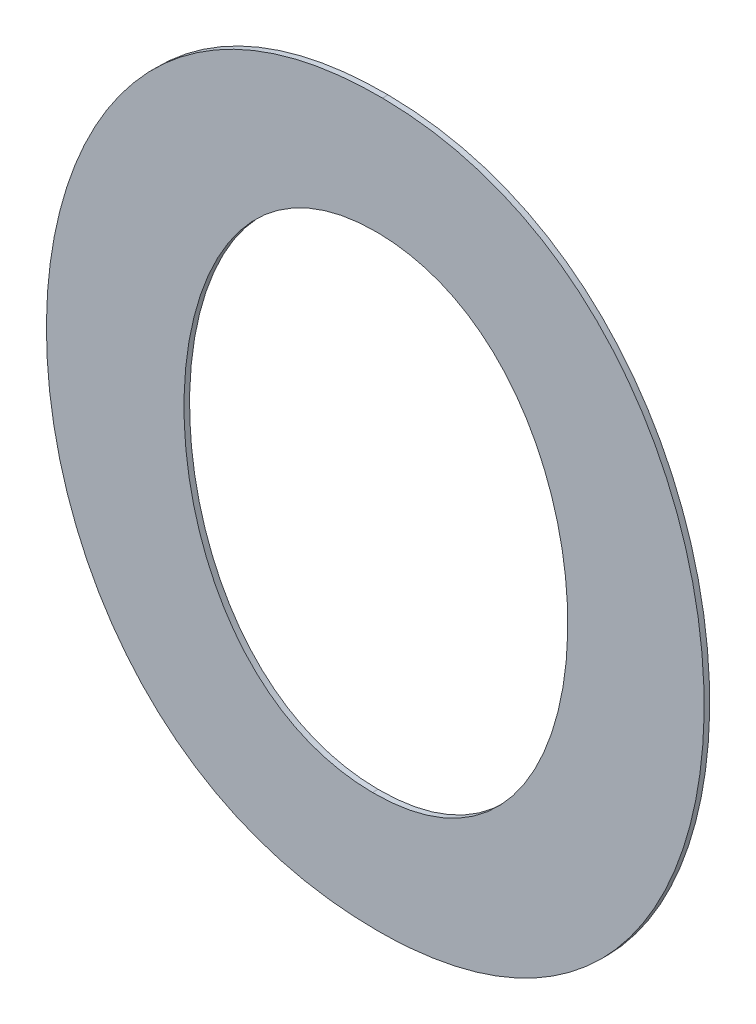
ISO-10303-21;
HEADER;
FILE_DESCRIPTION(('STEP AP214'),'2;1');
FILE_NAME('part.step','',(''),(''),'','','');
FILE_SCHEMA(('AUTOMOTIVE_DESIGN { 1 0 10303 214 1 1 1 1 }'));
ENDSEC;
DATA;
#1=APPLICATION_CONTEXT('core data for automotive mechanical design processes');
#2=APPLICATION_PROTOCOL_DEFINITION('international standard','automotive_design',2000,#1);
#3=PRODUCT_CONTEXT('',#1,'mechanical');
#4=PRODUCT('Part','Part','',(#3));
#5=PRODUCT_RELATED_PRODUCT_CATEGORY('part','',(#4));
#6=PRODUCT_DEFINITION_FORMATION('','',#4);
#7=PRODUCT_DEFINITION_CONTEXT('part definition',#1,'design');
#8=PRODUCT_DEFINITION('design','',#6,#7);
#9=PRODUCT_DEFINITION_SHAPE('','',#8);
#10=(LENGTH_UNIT() NAMED_UNIT(*) SI_UNIT(.MILLI.,.METRE.));
#11=(NAMED_UNIT(*) PLANE_ANGLE_UNIT() SI_UNIT($,.RADIAN.));
#12=(NAMED_UNIT(*) SI_UNIT($,.STERADIAN.) SOLID_ANGLE_UNIT());
#13=UNCERTAINTY_MEASURE_WITH_UNIT(LENGTH_MEASURE(1.E-05),#10,'distance_accuracy_value','');
#14=(GEOMETRIC_REPRESENTATION_CONTEXT(3) GLOBAL_UNCERTAINTY_ASSIGNED_CONTEXT((#13)) GLOBAL_UNIT_ASSIGNED_CONTEXT((#10,
#11,#12)) REPRESENTATION_CONTEXT('',''));
#15=CARTESIAN_POINT('',(0.,0.,0.));
#16=DIRECTION('',(0.,0.,1.));
#17=DIRECTION('',(1.,0.,0.));
#18=AXIS2_PLACEMENT_3D('',#15,#16,#17);
#19=CARTESIAN_POINT('',(-0.2468124433621,0.028711032855648,0.00086146168299));
#20=CARTESIAN_POINT('',(-0.2468124433621,0.028711032855648,-0.00057853831701));
#21=CARTESIAN_POINT('',(-0.3441750435949,0.028711032855648,0.00086146168299));
#22=CARTESIAN_POINT('',(-0.3441750435949,0.028711032855648,-0.00057853831701));
#23=CARTESIAN_POINT('',(-0.3405409245745,0.1857844483066,0.00086146168299));
#24=CARTESIAN_POINT('',(-0.3405409245745,0.1857844483066,-0.00057853831701));
#25=CARTESIAN_POINT('',(-0.2457287100561,0.1850511221026,0.00086146168299));
#26=CARTESIAN_POINT('',(-0.2457287100561,0.1850511221026,-0.00057853831701));
#27=B_SPLINE_SURFACE_WITH_KNOTS('',3,1,((#19,#20),(#21,#22),(#23,#24),(#25,#26)),.UNSPECIFIED.,
.F.,.F.,.F.,(4,4),(2,2),(0.,1.),(0.,0.00036),.UNSPECIFIED.);
#28=DIRECTION('',(0.,0.,1.));
#29=VECTOR('',#28,1.);
#30=CARTESIAN_POINT('',(-0.2468124433621,0.028711032855648,-0.00033853831701));
#31=LINE('',#30,#29);
#32=CARTESIAN_POINT('',(-0.2468124433621,0.028711032855648,-0.00033853831701));
#33=VERTEX_POINT('',#32);
#34=CARTESIAN_POINT('',(-0.2468124433621,0.028711032855648,0.00086146168299));
#35=VERTEX_POINT('',#34);
#36=EDGE_CURVE('E11',#33,#35,#31,.T.);
#37=CARTESIAN_POINT('',(-0.2468124433621,0.028711032855648,0.00086146168299));
#38=CARTESIAN_POINT('',(-0.3441750435949,0.028711032855648,0.00086146168299));
#39=CARTESIAN_POINT('',(-0.3405409245745,0.1857844483066,0.00086146168299));
#40=CARTESIAN_POINT('',(-0.2457287100561,0.1850511221026,0.00086146168299));
#41=B_SPLINE_CURVE_WITH_KNOTS('',3,(#37,#38,#39,#40),.UNSPECIFIED.,.F.,.F.,(4,4),(0.,1.),.UNSPECIFIED.);
#42=CARTESIAN_POINT('',(-0.2457287100561,0.1850511221026,0.00086146168299));
#43=VERTEX_POINT('',#42);
#44=EDGE_CURVE('E26',#35,#43,#41,.T.);
#45=DIRECTION('',(0.,0.,1.));
#46=VECTOR('',#45,1.);
#47=CARTESIAN_POINT('',(-0.2457287100561,0.1850511221026,-0.00033853831701));
#48=LINE('',#47,#46);
#49=CARTESIAN_POINT('',(-0.2457287100561,0.1850511221026,-0.00033853831701));
#50=VERTEX_POINT('',#49);
#51=EDGE_CURVE('E120',#50,#43,#48,.T.);
#52=CARTESIAN_POINT('',(-0.2468124433621,0.028711032855648,-0.00033853831701));
#53=CARTESIAN_POINT('',(-0.3441750435949,0.028711032855648,-0.00033853831701));
#54=CARTESIAN_POINT('',(-0.3405409245745,0.1857844483066,-0.00033853831701));
#55=CARTESIAN_POINT('',(-0.2457287100561,0.1850511221026,-0.00033853831701));
#56=B_SPLINE_CURVE_WITH_KNOTS('',3,(#52,#53,#54,#55),.UNSPECIFIED.,.F.,.F.,(4,4),(0.,1.),.UNSPECIFIED.);
#57=EDGE_CURVE('E112',#33,#50,#56,.T.);
#58=ORIENTED_EDGE('',*,*,#36,.T.);
#59=ORIENTED_EDGE('',*,*,#44,.T.);
#60=ORIENTED_EDGE('',*,*,#51,.F.);
#61=ORIENTED_EDGE('',*,*,#57,.F.);
#62=EDGE_LOOP('',(#58,#59,#60,#61));
#63=FACE_BOUND('',#62,.T.);
#64=ADVANCED_FACE('F17',(#63),#27,.T.);
#65=CARTESIAN_POINT('',(-0.2457287100561,0.1850511221026,0.00086146168299));
#66=CARTESIAN_POINT('',(-0.2457287100561,0.1850511221026,-0.00057853831701));
#67=CARTESIAN_POINT('',(-0.1541604705673,0.184334413143,0.00086146168299));
#68=CARTESIAN_POINT('',(-0.1541604705673,0.184334413143,-0.00057853831701));
#69=CARTESIAN_POINT('',(-0.1516245346309,0.028711032855648,0.00086146168299));
#70=CARTESIAN_POINT('',(-0.1516245346309,0.028711032855648,-0.00057853831701));
#71=CARTESIAN_POINT('',(-0.2468124433621,0.028711032855648,0.00086146168299));
#72=CARTESIAN_POINT('',(-0.2468124433621,0.028711032855648,-0.00057853831701));
#73=B_SPLINE_SURFACE_WITH_KNOTS('',3,1,((#65,#66),(#67,#68),(#69,#70),(#71,#72)),.UNSPECIFIED.,
.F.,.F.,.F.,(4,4),(2,2),(0.,1.),(0.,0.00036),.UNSPECIFIED.);
#74=CARTESIAN_POINT('',(-0.2457287100561,0.1850511221026,0.00086146168299));
#75=CARTESIAN_POINT('',(-0.1541604705673,0.184334413143,0.00086146168299));
#76=CARTESIAN_POINT('',(-0.1516245346309,0.028711032855648,0.00086146168299));
#77=CARTESIAN_POINT('',(-0.2468124433621,0.028711032855648,0.00086146168299));
#78=B_SPLINE_CURVE_WITH_KNOTS('',3,(#74,#75,#76,#77),.UNSPECIFIED.,.F.,.F.,(4,4),(0.,1.),.UNSPECIFIED.);
#79=EDGE_CURVE('E105',#43,#35,#78,.T.);
#80=CARTESIAN_POINT('',(-0.2457287100561,0.1850511221026,-0.00033853831701));
#81=CARTESIAN_POINT('',(-0.1541604705673,0.184334413143,-0.00033853831701));
#82=CARTESIAN_POINT('',(-0.1516245346309,0.028711032855648,-0.00033853831701));
#83=CARTESIAN_POINT('',(-0.2468124433621,0.028711032855648,-0.00033853831701));
#84=B_SPLINE_CURVE_WITH_KNOTS('',3,(#80,#81,#82,#83),.UNSPECIFIED.,.F.,.F.,(4,4),(0.,1.),.UNSPECIFIED.);
#85=EDGE_CURVE('E100',#50,#33,#84,.T.);
#86=ORIENTED_EDGE('',*,*,#51,.T.);
#87=ORIENTED_EDGE('',*,*,#79,.T.);
#88=ORIENTED_EDGE('',*,*,#36,.F.);
#89=ORIENTED_EDGE('',*,*,#85,.F.);
#90=EDGE_LOOP('',(#86,#87,#88,#89));
#91=FACE_BOUND('',#90,.T.);
#92=ADVANCED_FACE('F132',(#91),#73,.T.);
#93=CARTESIAN_POINT('',(-0.2478961766685,0.054034990267,0.00086146168299));
#94=CARTESIAN_POINT('',(-0.2478961766685,0.054034990267,-0.00057853831701));
#95=CARTESIAN_POINT('',(-0.1918093656261,0.0536853056534,0.00086146168299));
#96=CARTESIAN_POINT('',(-0.1918093656261,0.0536853056534,-0.00057853831701));
#97=CARTESIAN_POINT('',(-0.1918093656261,0.158643431385,0.00086146168299));
#98=CARTESIAN_POINT('',(-0.1918093656261,0.158643431385,-0.00057853831701));
#99=CARTESIAN_POINT('',(-0.2468124433621,0.159360140345,0.00086146168299));
#100=CARTESIAN_POINT('',(-0.2468124433621,0.159360140345,-0.00057853831701));
#101=B_SPLINE_SURFACE_WITH_KNOTS('',3,1,((#93,#94),(#95,#96),(#97,#98),(#99,#100)),
.UNSPECIFIED.,.F.,.F.,.F.,(4,4),(2,2),(0.,1.),(0.,0.00036),.UNSPECIFIED.);
#102=DIRECTION('',(0.,0.,1.));
#103=VECTOR('',#102,1.);
#104=CARTESIAN_POINT('',(-0.2478961766685,0.054034990267,-0.00033853831701));
#105=LINE('',#104,#103);
#106=CARTESIAN_POINT('',(-0.2478961766685,0.054034990267,-0.00033853831701));
#107=VERTEX_POINT('',#106);
#108=CARTESIAN_POINT('',(-0.2478961766685,0.054034990267,0.00086146168299));
#109=VERTEX_POINT('',#108);
#110=EDGE_CURVE('E74',#107,#109,#105,.T.);
#111=CARTESIAN_POINT('',(-0.2478961766685,0.054034990267,0.00086146168299));
#112=CARTESIAN_POINT('',(-0.1918093656261,0.0536853056534,0.00086146168299));
#113=CARTESIAN_POINT('',(-0.1918093656261,0.158643431385,0.00086146168299));
#114=CARTESIAN_POINT('',(-0.2468124433621,0.159360140345,0.00086146168299));
#115=B_SPLINE_CURVE_WITH_KNOTS('',3,(#111,#112,#113,#114),.UNSPECIFIED.,.F.,.F.,(4,4),(0.,1.),.UNSPECIFIED.);
#116=CARTESIAN_POINT('',(-0.2468124433621,0.159360140345,0.00086146168299));
#117=VERTEX_POINT('',#116);
#118=EDGE_CURVE('E62',#109,#117,#115,.T.);
#119=DIRECTION('',(0.,0.,1.));
#120=VECTOR('',#119,1.);
#121=CARTESIAN_POINT('',(-0.2468124433621,0.159360140345,-0.00033853831701));
#122=LINE('',#121,#120);
#123=CARTESIAN_POINT('',(-0.2468124433621,0.159360140345,-0.00033853831701));
#124=VERTEX_POINT('',#123);
#125=EDGE_CURVE('E56',#124,#117,#122,.T.);
#126=CARTESIAN_POINT('',(-0.2478961766685,0.054034990267,-0.00033853831701));
#127=CARTESIAN_POINT('',(-0.1918093656261,0.0536853056534,-0.00033853831701));
#128=CARTESIAN_POINT('',(-0.1918093656261,0.158643431385,-0.00033853831701));
#129=CARTESIAN_POINT('',(-0.2468124433621,0.159360140345,-0.00033853831701));
#130=B_SPLINE_CURVE_WITH_KNOTS('',3,(#126,#127,#128,#129),.UNSPECIFIED.,.F.,.F.,(4,4),(0.,1.),.UNSPECIFIED.);
#131=EDGE_CURVE('E59',#107,#124,#130,.T.);
#132=ORIENTED_EDGE('',*,*,#110,.T.);
#133=ORIENTED_EDGE('',*,*,#118,.T.);
#134=ORIENTED_EDGE('',*,*,#125,.F.);
#135=ORIENTED_EDGE('',*,*,#131,.F.);
#136=EDGE_LOOP('',(#132,#133,#134,#135));
#137=FACE_BOUND('',#136,.T.);
#138=ADVANCED_FACE('F58',(#137),#101,.T.);
#139=CARTESIAN_POINT('',(-0.2468124433621,0.159360140345,0.00086146168299));
#140=CARTESIAN_POINT('',(-0.2468124433621,0.159360140345,-0.00057853831701));
#141=CARTESIAN_POINT('',(-0.3014542766629,0.1597271646914,0.00086146168299));
#142=CARTESIAN_POINT('',(-0.3014542766629,0.1597271646914,-0.00057853831701));
#143=CARTESIAN_POINT('',(-0.3032749486173,0.0544020146134,0.00086146168299));
#144=CARTESIAN_POINT('',(-0.3032749486173,0.0544020146134,-0.00057853831701));
#145=CARTESIAN_POINT('',(-0.2478961766685,0.054034990267,0.00086146168299));
#146=CARTESIAN_POINT('',(-0.2478961766685,0.054034990267,-0.00057853831701));
#147=B_SPLINE_SURFACE_WITH_KNOTS('',3,1,((#139,#140),(#141,#142),(#143,#144),(#145,#146)),
.UNSPECIFIED.,.F.,.F.,.F.,(4,4),(2,2),(0.,1.),(0.,0.00036),.UNSPECIFIED.);
#148=CARTESIAN_POINT('',(-0.2468124433621,0.159360140345,0.00086146168299));
#149=CARTESIAN_POINT('',(-0.3014542766629,0.1597271646914,0.00086146168299));
#150=CARTESIAN_POINT('',(-0.3032749486173,0.0544020146134,0.00086146168299));
#151=CARTESIAN_POINT('',(-0.2478961766685,0.054034990267,0.00086146168299));
#152=B_SPLINE_CURVE_WITH_KNOTS('',3,(#148,#149,#150,#151),.UNSPECIFIED.,.F.,.F.,(4,4),(0.,1.),.UNSPECIFIED.);
#153=EDGE_CURVE('E71',#117,#109,#152,.T.);
#154=CARTESIAN_POINT('',(-0.2468124433621,0.159360140345,-0.00033853831701));
#155=CARTESIAN_POINT('',(-0.3014542766629,0.1597271646914,-0.00033853831701));
#156=CARTESIAN_POINT('',(-0.3032749486173,0.0544020146134,-0.00033853831701));
#157=CARTESIAN_POINT('',(-0.2478961766685,0.054034990267,-0.00033853831701));
#158=B_SPLINE_CURVE_WITH_KNOTS('',3,(#154,#155,#156,#157),.UNSPECIFIED.,.F.,.F.,(4,4),(0.,1.),.UNSPECIFIED.);
#159=EDGE_CURVE('E70',#124,#107,#158,.T.);
#160=ORIENTED_EDGE('',*,*,#125,.T.);
#161=ORIENTED_EDGE('',*,*,#153,.T.);
#162=ORIENTED_EDGE('',*,*,#110,.F.);
#163=ORIENTED_EDGE('',*,*,#159,.F.);
#164=EDGE_LOOP('',(#160,#161,#162,#163));
#165=FACE_BOUND('',#164,.T.);
#166=ADVANCED_FACE('F73',(#165),#147,.T.);
#167=CARTESIAN_POINT('',(-0.2478997891129,0.028711032855648,-0.00033853831701));
#168=DIRECTION('',(0.,0.,1.));
#169=DIRECTION('',(1.,0.,0.));
#170=AXIS2_PLACEMENT_3D('',#167,#168,#169);
#171=PLANE('',#170);
#172=ORIENTED_EDGE('',*,*,#57,.T.);
#173=ORIENTED_EDGE('',*,*,#85,.T.);
#174=EDGE_LOOP('',(#172,#173));
#175=FACE_BOUND('',#174,.T.);
#176=ORIENTED_EDGE('',*,*,#131,.T.);
#177=ORIENTED_EDGE('',*,*,#159,.T.);
#178=EDGE_LOOP('',(#176,#177));
#179=FACE_BOUND('',#178,.T.);
#180=ADVANCED_FACE('F69',(#175,#179),#171,.F.);
#181=CARTESIAN_POINT('',(-0.2478997891129,0.028711032855648,0.00086146168299));
#182=DIRECTION('',(0.,0.,1.));
#183=DIRECTION('',(1.,0.,0.));
#184=AXIS2_PLACEMENT_3D('',#181,#182,#183);
#185=PLANE('',#184);
#186=ORIENTED_EDGE('',*,*,#44,.F.);
#187=ORIENTED_EDGE('',*,*,#79,.F.);
#188=EDGE_LOOP('',(#186,#187));
#189=FACE_BOUND('',#188,.T.);
#190=ORIENTED_EDGE('',*,*,#118,.F.);
#191=ORIENTED_EDGE('',*,*,#153,.F.);
#192=EDGE_LOOP('',(#190,#191));
#193=FACE_BOUND('',#192,.T.);
#194=ADVANCED_FACE('F133',(#189,#193),#185,.T.);
#195=CLOSED_SHELL('',(#64,#92,#138,#166,#180,#194));
#196=MANIFOLD_SOLID_BREP('B1',#195);
#197=ADVANCED_BREP_SHAPE_REPRESENTATION('',(#18,#196),#14);
#198=SHAPE_DEFINITION_REPRESENTATION(#9,#197);
ENDSEC;
END-ISO-10303-21;
